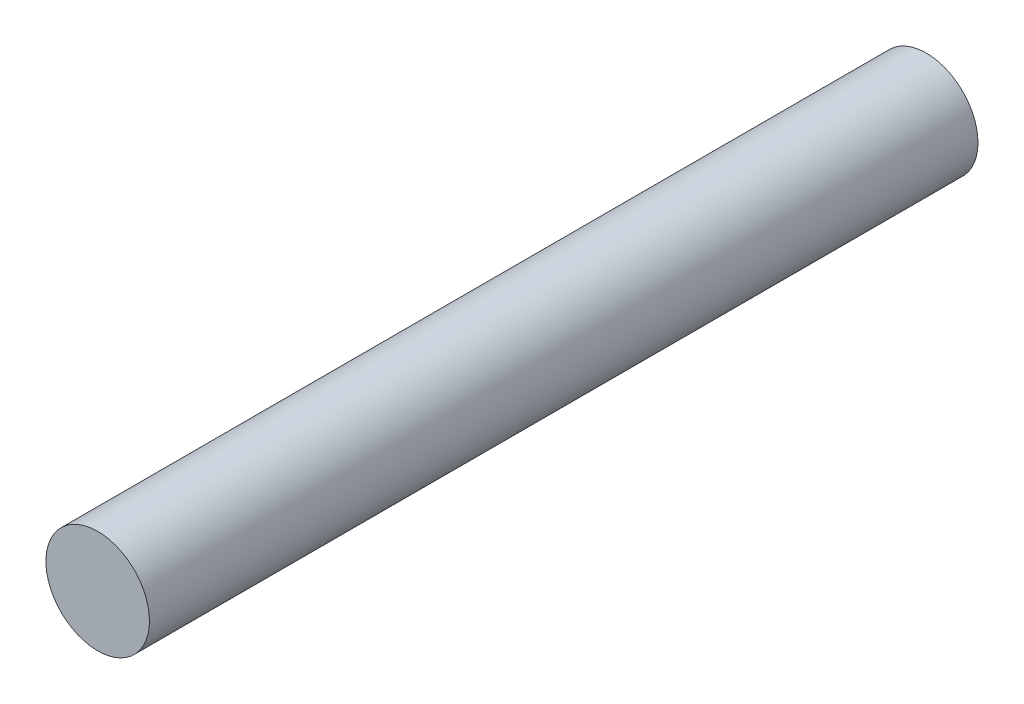
ISO-10303-21;
HEADER;
FILE_DESCRIPTION(('STEP AP214'),'2;1');
FILE_NAME('part.step','',(''),(''),'','','');
FILE_SCHEMA(('AUTOMOTIVE_DESIGN { 1 0 10303 214 1 1 1 1 }'));
ENDSEC;
DATA;
#1=APPLICATION_CONTEXT('core data for automotive mechanical design processes');
#2=APPLICATION_PROTOCOL_DEFINITION('international standard','automotive_design',2000,#1);
#3=PRODUCT_CONTEXT('',#1,'mechanical');
#4=PRODUCT('Part','Part','',(#3));
#5=PRODUCT_RELATED_PRODUCT_CATEGORY('part','',(#4));
#6=PRODUCT_DEFINITION_FORMATION('','',#4);
#7=PRODUCT_DEFINITION_CONTEXT('part definition',#1,'design');
#8=PRODUCT_DEFINITION('design','',#6,#7);
#9=PRODUCT_DEFINITION_SHAPE('','',#8);
#10=(LENGTH_UNIT() NAMED_UNIT(*) SI_UNIT(.MILLI.,.METRE.));
#11=(NAMED_UNIT(*) PLANE_ANGLE_UNIT() SI_UNIT($,.RADIAN.));
#12=(NAMED_UNIT(*) SI_UNIT($,.STERADIAN.) SOLID_ANGLE_UNIT());
#13=UNCERTAINTY_MEASURE_WITH_UNIT(LENGTH_MEASURE(1.E-05),#10,'distance_accuracy_value','');
#14=(GEOMETRIC_REPRESENTATION_CONTEXT(3) GLOBAL_UNCERTAINTY_ASSIGNED_CONTEXT((#13)) GLOBAL_UNIT_ASSIGNED_CONTEXT((#10,
#11,#12)) REPRESENTATION_CONTEXT('',''));
#15=CARTESIAN_POINT('',(0.,0.,0.));
#16=DIRECTION('',(0.,0.,1.));
#17=DIRECTION('',(1.,0.,0.));
#18=AXIS2_PLACEMENT_3D('',#15,#16,#17);
#19=CARTESIAN_POINT('',(0.,0.,101.6));
#20=DIRECTION('',(0.,0.,-1.));
#21=DIRECTION('',(-1.,0.,0.));
#22=AXIS2_PLACEMENT_3D('',#19,#20,#21);
#23=CYLINDRICAL_SURFACE('',#22,6.35);
#24=CARTESIAN_POINT('',(0.,0.,101.6));
#25=DIRECTION('',(0.,0.,1.));
#26=DIRECTION('',(1.,0.,0.));
#27=AXIS2_PLACEMENT_3D('',#24,#25,#26);
#28=CIRCLE('',#27,6.35);
#29=CARTESIAN_POINT('',(6.35,0.,101.6));
#30=VERTEX_POINT('',#29);
#31=EDGE_CURVE('E10',#30,#30,#28,.T.);
#32=ORIENTED_EDGE('',*,*,#31,.F.);
#33=EDGE_LOOP('',(#32));
#34=FACE_BOUND('',#33,.T.);
#35=CARTESIAN_POINT('',(0.,0.,0.));
#36=DIRECTION('',(0.,0.,1.));
#37=DIRECTION('',(1.,0.,0.));
#38=AXIS2_PLACEMENT_3D('',#35,#36,#37);
#39=CIRCLE('',#38,6.35);
#40=CARTESIAN_POINT('',(6.35,0.,0.));
#41=VERTEX_POINT('',#40);
#42=EDGE_CURVE('E40',#41,#41,#39,.T.);
#43=ORIENTED_EDGE('',*,*,#42,.T.);
#44=EDGE_LOOP('',(#43));
#45=FACE_BOUND('',#44,.T.);
#46=ADVANCED_FACE('F37',(#34,#45),#23,.T.);
#47=CARTESIAN_POINT('',(0.,0.,101.6));
#48=DIRECTION('',(0.,0.,1.));
#49=DIRECTION('',(1.,0.,0.));
#50=AXIS2_PLACEMENT_3D('',#47,#48,#49);
#51=PLANE('',#50);
#52=ORIENTED_EDGE('',*,*,#31,.T.);
#53=EDGE_LOOP('',(#52));
#54=FACE_BOUND('',#53,.T.);
#55=ADVANCED_FACE('F54',(#54),#51,.T.);
#56=CARTESIAN_POINT('',(0.,0.,0.));
#57=DIRECTION('',(0.,0.,1.));
#58=DIRECTION('',(1.,0.,0.));
#59=AXIS2_PLACEMENT_3D('',#56,#57,#58);
#60=PLANE('',#59);
#61=ORIENTED_EDGE('',*,*,#42,.F.);
#62=EDGE_LOOP('',(#61));
#63=FACE_BOUND('',#62,.T.);
#64=ADVANCED_FACE('F52',(#63),#60,.F.);
#65=CLOSED_SHELL('',(#46,#55,#64));
#66=MANIFOLD_SOLID_BREP('B2',#65);
#67=ADVANCED_BREP_SHAPE_REPRESENTATION('',(#18,#66),#14);
#68=SHAPE_DEFINITION_REPRESENTATION(#9,#67);
ENDSEC;
END-ISO-10303-21;
